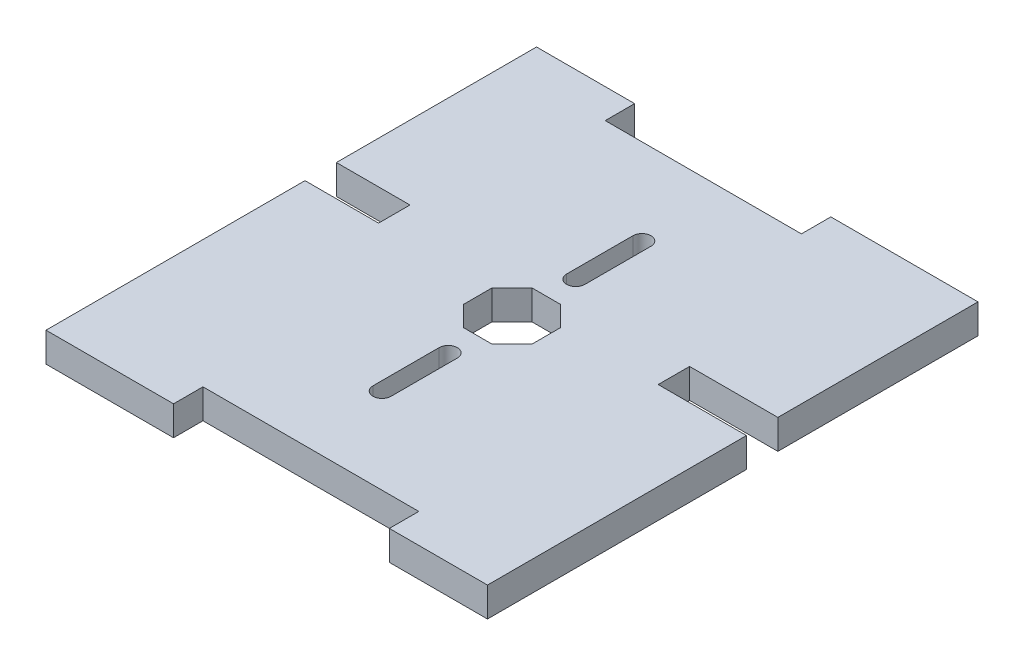
ISO-10303-21;
HEADER;
FILE_DESCRIPTION(('STEP AP214'),'2;1');
FILE_NAME('part.step','',(''),(''),'','','');
FILE_SCHEMA(('AUTOMOTIVE_DESIGN { 1 0 10303 214 1 1 1 1 }'));
ENDSEC;
DATA;
#1=APPLICATION_CONTEXT('core data for automotive mechanical design processes');
#2=APPLICATION_PROTOCOL_DEFINITION('international standard','automotive_design',2000,#1);
#3=PRODUCT_CONTEXT('',#1,'mechanical');
#4=PRODUCT('Part','Part','',(#3));
#5=PRODUCT_RELATED_PRODUCT_CATEGORY('part','',(#4));
#6=PRODUCT_DEFINITION_FORMATION('','',#4);
#7=PRODUCT_DEFINITION_CONTEXT('part definition',#1,'design');
#8=PRODUCT_DEFINITION('design','',#6,#7);
#9=PRODUCT_DEFINITION_SHAPE('','',#8);
#10=(LENGTH_UNIT() NAMED_UNIT(*) SI_UNIT(.MILLI.,.METRE.));
#11=(NAMED_UNIT(*) PLANE_ANGLE_UNIT() SI_UNIT($,.RADIAN.));
#12=(NAMED_UNIT(*) SI_UNIT($,.STERADIAN.) SOLID_ANGLE_UNIT());
#13=UNCERTAINTY_MEASURE_WITH_UNIT(LENGTH_MEASURE(1.E-05),#10,'distance_accuracy_value','');
#14=(GEOMETRIC_REPRESENTATION_CONTEXT(3) GLOBAL_UNCERTAINTY_ASSIGNED_CONTEXT((#13)) GLOBAL_UNIT_ASSIGNED_CONTEXT((#10,
#11,#12)) REPRESENTATION_CONTEXT('',''));
#15=CARTESIAN_POINT('',(0.,0.,0.));
#16=DIRECTION('',(0.,0.,1.));
#17=DIRECTION('',(1.,0.,0.));
#18=AXIS2_PLACEMENT_3D('',#15,#16,#17);
#19=CARTESIAN_POINT('',(0.,3.,0.));
#20=DIRECTION('',(1.,0.,0.));
#21=DIRECTION('',(0.,0.,-1.));
#22=AXIS2_PLACEMENT_3D('',#19,#20,#21);
#23=PLANE('',#22);
#24=DIRECTION('',(0.,0.,1.));
#25=VECTOR('',#24,1.);
#26=CARTESIAN_POINT('',(0.,0.,0.));
#27=LINE('',#26,#25);
#28=CARTESIAN_POINT('',(0.,0.,-50.));
#29=VERTEX_POINT('',#28);
#30=CARTESIAN_POINT('',(0.,0.,-29.6));
#31=VERTEX_POINT('',#30);
#32=EDGE_CURVE('E293',#29,#31,#27,.T.);
#33=ORIENTED_EDGE('',*,*,#32,.T.);
#34=DIRECTION('',(0.,1.,0.));
#35=VECTOR('',#34,1.);
#36=CARTESIAN_POINT('',(0.,0.,-29.6));
#37=LINE('',#36,#35);
#38=CARTESIAN_POINT('',(0.,3.,-29.6));
#39=VERTEX_POINT('',#38);
#40=EDGE_CURVE('E363',#31,#39,#37,.T.);
#41=ORIENTED_EDGE('',*,*,#40,.T.);
#42=DIRECTION('',(0.,0.,1.));
#43=VECTOR('',#42,1.);
#44=CARTESIAN_POINT('',(0.,3.,0.));
#45=LINE('',#44,#43);
#46=CARTESIAN_POINT('',(0.,3.,-50.));
#47=VERTEX_POINT('',#46);
#48=EDGE_CURVE('E546',#47,#39,#45,.T.);
#49=ORIENTED_EDGE('',*,*,#48,.F.);
#50=DIRECTION('',(0.,-1.,0.));
#51=VECTOR('',#50,1.);
#52=CARTESIAN_POINT('',(0.,3.,-50.));
#53=LINE('',#52,#51);
#54=EDGE_CURVE('E313',#47,#29,#53,.T.);
#55=ORIENTED_EDGE('',*,*,#54,.T.);
#56=EDGE_LOOP('',(#33,#41,#49,#55));
#57=FACE_BOUND('',#56,.T.);
#58=ADVANCED_FACE('F35',(#57),#23,.F.);
#59=CARTESIAN_POINT('',(0.,3.,0.));
#60=DIRECTION('',(0.,0.,-1.));
#61=DIRECTION('',(-1.,0.,0.));
#62=AXIS2_PLACEMENT_3D('',#59,#60,#61);
#63=PLANE('',#62);
#64=DIRECTION('',(1.,0.,0.));
#65=VECTOR('',#64,1.);
#66=CARTESIAN_POINT('',(0.,0.,0.));
#67=LINE('',#66,#65);
#68=CARTESIAN_POINT('',(0.,0.,0.));
#69=VERTEX_POINT('',#68);
#70=CARTESIAN_POINT('',(13.,0.,0.));
#71=VERTEX_POINT('',#70);
#72=EDGE_CURVE('E292',#69,#71,#67,.T.);
#73=ORIENTED_EDGE('',*,*,#72,.T.);
#74=DIRECTION('',(0.,1.,0.));
#75=VECTOR('',#74,1.);
#76=CARTESIAN_POINT('',(13.,0.,0.));
#77=LINE('',#76,#75);
#78=CARTESIAN_POINT('',(13.,3.,0.));
#79=VERTEX_POINT('',#78);
#80=EDGE_CURVE('E528',#71,#79,#77,.T.);
#81=ORIENTED_EDGE('',*,*,#80,.T.);
#82=DIRECTION('',(1.,0.,0.));
#83=VECTOR('',#82,1.);
#84=CARTESIAN_POINT('',(0.,3.,0.));
#85=LINE('',#84,#83);
#86=CARTESIAN_POINT('',(0.,3.,0.));
#87=VERTEX_POINT('',#86);
#88=EDGE_CURVE('E550',#87,#79,#85,.T.);
#89=ORIENTED_EDGE('',*,*,#88,.F.);
#90=DIRECTION('',(0.,-1.,0.));
#91=VECTOR('',#90,1.);
#92=CARTESIAN_POINT('',(0.,3.,0.));
#93=LINE('',#92,#91);
#94=EDGE_CURVE('E11',#87,#69,#93,.T.);
#95=ORIENTED_EDGE('',*,*,#94,.T.);
#96=EDGE_LOOP('',(#73,#81,#89,#95));
#97=FACE_BOUND('',#96,.T.);
#98=ADVANCED_FACE('F599',(#97),#63,.F.);
#99=CARTESIAN_POINT('',(45.,3.,0.));
#100=DIRECTION('',(-1.,0.,0.));
#101=DIRECTION('',(0.,0.,1.));
#102=AXIS2_PLACEMENT_3D('',#99,#100,#101);
#103=PLANE('',#102);
#104=DIRECTION('',(0.,0.,-1.));
#105=VECTOR('',#104,1.);
#106=CARTESIAN_POINT('',(45.,0.,0.));
#107=LINE('',#106,#105);
#108=CARTESIAN_POINT('',(45.,0.,0.));
#109=VERTEX_POINT('',#108);
#110=CARTESIAN_POINT('',(45.,0.,-26.4));
#111=VERTEX_POINT('',#110);
#112=EDGE_CURVE('E306',#109,#111,#107,.T.);
#113=ORIENTED_EDGE('',*,*,#112,.T.);
#114=DIRECTION('',(0.,1.,0.));
#115=VECTOR('',#114,1.);
#116=CARTESIAN_POINT('',(45.,0.,-26.4));
#117=LINE('',#116,#115);
#118=CARTESIAN_POINT('',(45.,3.,-26.4));
#119=VERTEX_POINT('',#118);
#120=EDGE_CURVE('E341',#111,#119,#117,.T.);
#121=ORIENTED_EDGE('',*,*,#120,.T.);
#122=DIRECTION('',(0.,0.,-1.));
#123=VECTOR('',#122,1.);
#124=CARTESIAN_POINT('',(45.,3.,0.));
#125=LINE('',#124,#123);
#126=CARTESIAN_POINT('',(45.,3.,0.));
#127=VERTEX_POINT('',#126);
#128=EDGE_CURVE('E326',#127,#119,#125,.T.);
#129=ORIENTED_EDGE('',*,*,#128,.F.);
#130=DIRECTION('',(0.,-1.,0.));
#131=VECTOR('',#130,1.);
#132=CARTESIAN_POINT('',(45.,3.,0.));
#133=LINE('',#132,#131);
#134=EDGE_CURVE('E43',#127,#109,#133,.T.);
#135=ORIENTED_EDGE('',*,*,#134,.T.);
#136=EDGE_LOOP('',(#113,#121,#129,#135));
#137=FACE_BOUND('',#136,.T.);
#138=ADVANCED_FACE('F323',(#137),#103,.F.);
#139=CARTESIAN_POINT('',(0.,3.,-50.));
#140=DIRECTION('',(0.,0.,1.));
#141=DIRECTION('',(1.,0.,0.));
#142=AXIS2_PLACEMENT_3D('',#139,#140,#141);
#143=PLANE('',#142);
#144=DIRECTION('',(-1.,0.,0.));
#145=VECTOR('',#144,1.);
#146=CARTESIAN_POINT('',(0.,3.,-50.));
#147=LINE('',#146,#145);
#148=CARTESIAN_POINT('',(10.,3.,-50.));
#149=VERTEX_POINT('',#148);
#150=EDGE_CURVE('E553',#149,#47,#147,.T.);
#151=ORIENTED_EDGE('',*,*,#150,.F.);
#152=DIRECTION('',(0.,1.,0.));
#153=VECTOR('',#152,1.);
#154=CARTESIAN_POINT('',(10.,0.,-50.));
#155=LINE('',#154,#153);
#156=CARTESIAN_POINT('',(10.,0.,-50.));
#157=VERTEX_POINT('',#156);
#158=EDGE_CURVE('E294',#157,#149,#155,.T.);
#159=ORIENTED_EDGE('',*,*,#158,.F.);
#160=DIRECTION('',(-1.,0.,0.));
#161=VECTOR('',#160,1.);
#162=CARTESIAN_POINT('',(0.,0.,-50.));
#163=LINE('',#162,#161);
#164=EDGE_CURVE('E309',#157,#29,#163,.T.);
#165=ORIENTED_EDGE('',*,*,#164,.T.);
#166=ORIENTED_EDGE('',*,*,#54,.F.);
#167=EDGE_LOOP('',(#151,#159,#165,#166));
#168=FACE_BOUND('',#167,.T.);
#169=ADVANCED_FACE('F584',(#168),#143,.F.);
#170=CARTESIAN_POINT('',(0.,3.,-26.4));
#171=VERTEX_POINT('',#170);
#172=EDGE_CURVE('E285',#171,#87,#45,.T.);
#173=ORIENTED_EDGE('',*,*,#172,.F.);
#174=DIRECTION('',(0.,1.,0.));
#175=VECTOR('',#174,1.);
#176=CARTESIAN_POINT('',(0.,0.,-26.4));
#177=LINE('',#176,#175);
#178=CARTESIAN_POINT('',(0.,0.,-26.4));
#179=VERTEX_POINT('',#178);
#180=EDGE_CURVE('E272',#179,#171,#177,.T.);
#181=ORIENTED_EDGE('',*,*,#180,.F.);
#182=EDGE_CURVE('E283',#179,#69,#27,.T.);
#183=ORIENTED_EDGE('',*,*,#182,.T.);
#184=ORIENTED_EDGE('',*,*,#94,.F.);
#185=EDGE_LOOP('',(#173,#181,#183,#184));
#186=FACE_BOUND('',#185,.T.);
#187=ADVANCED_FACE('F37',(#186),#23,.F.);
#188=CARTESIAN_POINT('',(35.,3.,0.));
#189=VERTEX_POINT('',#188);
#190=EDGE_CURVE('E549',#189,#127,#85,.T.);
#191=ORIENTED_EDGE('',*,*,#190,.F.);
#192=DIRECTION('',(0.,1.,0.));
#193=VECTOR('',#192,1.);
#194=CARTESIAN_POINT('',(35.,0.,0.));
#195=LINE('',#194,#193);
#196=CARTESIAN_POINT('',(35.,0.,0.));
#197=VERTEX_POINT('',#196);
#198=EDGE_CURVE('E540',#197,#189,#195,.T.);
#199=ORIENTED_EDGE('',*,*,#198,.F.);
#200=EDGE_CURVE('E297',#197,#109,#67,.T.);
#201=ORIENTED_EDGE('',*,*,#200,.T.);
#202=ORIENTED_EDGE('',*,*,#134,.F.);
#203=EDGE_LOOP('',(#191,#199,#201,#202));
#204=FACE_BOUND('',#203,.T.);
#205=ADVANCED_FACE('F611',(#204),#63,.F.);
#206=CARTESIAN_POINT('',(45.,3.,-29.6));
#207=VERTEX_POINT('',#206);
#208=CARTESIAN_POINT('',(45.,3.,-50.));
#209=VERTEX_POINT('',#208);
#210=EDGE_CURVE('E552',#207,#209,#125,.T.);
#211=ORIENTED_EDGE('',*,*,#210,.F.);
#212=DIRECTION('',(0.,1.,0.));
#213=VECTOR('',#212,1.);
#214=CARTESIAN_POINT('',(45.,0.,-29.6));
#215=LINE('',#214,#213);
#216=CARTESIAN_POINT('',(45.,0.,-29.6));
#217=VERTEX_POINT('',#216);
#218=EDGE_CURVE('E350',#217,#207,#215,.T.);
#219=ORIENTED_EDGE('',*,*,#218,.F.);
#220=CARTESIAN_POINT('',(45.,0.,-50.));
#221=VERTEX_POINT('',#220);
#222=EDGE_CURVE('E305',#217,#221,#107,.T.);
#223=ORIENTED_EDGE('',*,*,#222,.T.);
#224=DIRECTION('',(0.,-1.,0.));
#225=VECTOR('',#224,1.);
#226=CARTESIAN_POINT('',(45.,3.,-50.));
#227=LINE('',#226,#225);
#228=EDGE_CURVE('E316',#209,#221,#227,.T.);
#229=ORIENTED_EDGE('',*,*,#228,.F.);
#230=EDGE_LOOP('',(#211,#219,#223,#229));
#231=FACE_BOUND('',#230,.T.);
#232=ADVANCED_FACE('F565',(#231),#103,.F.);
#233=CARTESIAN_POINT('',(30.,0.,-50.));
#234=VERTEX_POINT('',#233);
#235=EDGE_CURVE('E310',#221,#234,#163,.T.);
#236=ORIENTED_EDGE('',*,*,#235,.T.);
#237=DIRECTION('',(0.,1.,0.));
#238=VECTOR('',#237,1.);
#239=CARTESIAN_POINT('',(30.,0.,-50.));
#240=LINE('',#239,#238);
#241=CARTESIAN_POINT('',(30.,3.,-50.));
#242=VERTEX_POINT('',#241);
#243=EDGE_CURVE('E298',#234,#242,#240,.T.);
#244=ORIENTED_EDGE('',*,*,#243,.T.);
#245=EDGE_CURVE('E302',#209,#242,#147,.T.);
#246=ORIENTED_EDGE('',*,*,#245,.F.);
#247=ORIENTED_EDGE('',*,*,#228,.T.);
#248=EDGE_LOOP('',(#236,#244,#246,#247));
#249=FACE_BOUND('',#248,.T.);
#250=ADVANCED_FACE('F569',(#249),#143,.F.);
#251=CARTESIAN_POINT('',(0.,3.,0.));
#252=DIRECTION('',(0.,-1.,0.));
#253=DIRECTION('',(0.,0.,-1.));
#254=AXIS2_PLACEMENT_3D('',#251,#252,#253);
#255=PLANE('',#254);
#256=DIRECTION('',(0.,0.,1.));
#257=VECTOR('',#256,1.);
#258=CARTESIAN_POINT('',(21.575,3.,-18.5));
#259=LINE('',#258,#257);
#260=CARTESIAN_POINT('',(21.575,3.,-18.5));
#261=VERTEX_POINT('',#260);
#262=CARTESIAN_POINT('',(21.575,3.,-11.75));
#263=VERTEX_POINT('',#262);
#264=EDGE_CURVE('E439',#261,#263,#259,.T.);
#265=ORIENTED_EDGE('',*,*,#264,.F.);
#266=CARTESIAN_POINT('',(22.5,3.,-18.5));
#267=DIRECTION('',(0.,1.,0.));
#268=DIRECTION('',(0.,0.,1.));
#269=AXIS2_PLACEMENT_3D('',#266,#267,#268);
#270=CIRCLE('',#269,0.925000000000002);
#271=CARTESIAN_POINT('',(23.425,3.,-18.5));
#272=VERTEX_POINT('',#271);
#273=EDGE_CURVE('E50',#272,#261,#270,.T.);
#274=ORIENTED_EDGE('',*,*,#273,.F.);
#275=DIRECTION('',(0.,0.,-1.));
#276=VECTOR('',#275,1.);
#277=CARTESIAN_POINT('',(23.425,3.,-18.5));
#278=LINE('',#277,#276);
#279=CARTESIAN_POINT('',(23.425,3.,-11.75));
#280=VERTEX_POINT('',#279);
#281=EDGE_CURVE('E428',#280,#272,#278,.T.);
#282=ORIENTED_EDGE('',*,*,#281,.F.);
#283=CARTESIAN_POINT('',(22.5,3.,-11.75));
#284=DIRECTION('',(0.,1.,0.));
#285=DIRECTION('',(0.,0.,1.));
#286=AXIS2_PLACEMENT_3D('',#283,#284,#285);
#287=CIRCLE('',#286,0.925000000000002);
#288=EDGE_CURVE('E442',#263,#280,#287,.T.);
#289=ORIENTED_EDGE('',*,*,#288,.F.);
#290=EDGE_LOOP('',(#265,#274,#282,#289));
#291=FACE_BOUND('',#290,.T.);
#292=DIRECTION('',(0.,0.,-1.));
#293=VECTOR('',#292,1.);
#294=CARTESIAN_POINT('',(23.425,3.,-31.5));
#295=LINE('',#294,#293);
#296=CARTESIAN_POINT('',(23.425,3.,-31.5));
#297=VERTEX_POINT('',#296);
#298=CARTESIAN_POINT('',(23.425,3.,-38.25));
#299=VERTEX_POINT('',#298);
#300=EDGE_CURVE('E407',#297,#299,#295,.T.);
#301=ORIENTED_EDGE('',*,*,#300,.F.);
#302=CARTESIAN_POINT('',(22.5,3.,-31.5));
#303=DIRECTION('',(0.,1.,0.));
#304=DIRECTION('',(0.,0.,1.));
#305=AXIS2_PLACEMENT_3D('',#302,#303,#304);
#306=CIRCLE('',#305,0.924999999999997);
#307=CARTESIAN_POINT('',(21.575,3.,-31.5));
#308=VERTEX_POINT('',#307);
#309=EDGE_CURVE('E58',#308,#297,#306,.T.);
#310=ORIENTED_EDGE('',*,*,#309,.F.);
#311=DIRECTION('',(0.,0.,1.));
#312=VECTOR('',#311,1.);
#313=CARTESIAN_POINT('',(21.575,3.,-31.5));
#314=LINE('',#313,#312);
#315=CARTESIAN_POINT('',(21.575,3.,-38.25));
#316=VERTEX_POINT('',#315);
#317=EDGE_CURVE('E396',#316,#308,#314,.T.);
#318=ORIENTED_EDGE('',*,*,#317,.F.);
#319=CARTESIAN_POINT('',(22.5,3.,-38.25));
#320=DIRECTION('',(0.,1.,0.));
#321=DIRECTION('',(0.,0.,1.));
#322=AXIS2_PLACEMENT_3D('',#319,#320,#321);
#323=CIRCLE('',#322,0.925);
#324=EDGE_CURVE('E411',#299,#316,#323,.T.);
#325=ORIENTED_EDGE('',*,*,#324,.F.);
#326=EDGE_LOOP('',(#301,#310,#318,#325));
#327=FACE_BOUND('',#326,.T.);
#328=DIRECTION('',(1.,0.,0.));
#329=VECTOR('',#328,1.);
#330=CARTESIAN_POINT('',(21.0502525316942,3.,-21.5));
#331=LINE('',#330,#329);
#332=CARTESIAN_POINT('',(21.0502525316942,3.,-21.5));
#333=VERTEX_POINT('',#332);
#334=CARTESIAN_POINT('',(23.9497474683058,3.,-21.5));
#335=VERTEX_POINT('',#334);
#336=EDGE_CURVE('E485',#333,#335,#331,.T.);
#337=ORIENTED_EDGE('',*,*,#336,.F.);
#338=DIRECTION('',(0.707106781186548,0.,0.707106781186548));
#339=VECTOR('',#338,1.);
#340=CARTESIAN_POINT('',(19.,3.,-23.5502525316942));
#341=LINE('',#340,#339);
#342=CARTESIAN_POINT('',(19.,3.,-23.5502525316942));
#343=VERTEX_POINT('',#342);
#344=EDGE_CURVE('E418',#343,#333,#341,.T.);
#345=ORIENTED_EDGE('',*,*,#344,.F.);
#346=DIRECTION('',(0.,0.,1.));
#347=VECTOR('',#346,1.);
#348=CARTESIAN_POINT('',(19.,3.,-26.4497474683058));
#349=LINE('',#348,#347);
#350=CARTESIAN_POINT('',(19.,3.,-26.4497474683058));
#351=VERTEX_POINT('',#350);
#352=EDGE_CURVE('E462',#351,#343,#349,.T.);
#353=ORIENTED_EDGE('',*,*,#352,.F.);
#354=DIRECTION('',(-0.707106781186547,0.,0.707106781186547));
#355=VECTOR('',#354,1.);
#356=CARTESIAN_POINT('',(21.0502525316942,3.,-28.5));
#357=LINE('',#356,#355);
#358=CARTESIAN_POINT('',(21.0502525316942,3.,-28.5));
#359=VERTEX_POINT('',#358);
#360=EDGE_CURVE('E500',#359,#351,#357,.T.);
#361=ORIENTED_EDGE('',*,*,#360,.F.);
#362=DIRECTION('',(-1.,0.,0.));
#363=VECTOR('',#362,1.);
#364=CARTESIAN_POINT('',(23.9497474683058,3.,-28.5));
#365=LINE('',#364,#363);
#366=CARTESIAN_POINT('',(23.9497474683058,3.,-28.5));
#367=VERTEX_POINT('',#366);
#368=EDGE_CURVE('E497',#367,#359,#365,.T.);
#369=ORIENTED_EDGE('',*,*,#368,.F.);
#370=DIRECTION('',(-0.707106781186548,0.,-0.707106781186548));
#371=VECTOR('',#370,1.);
#372=CARTESIAN_POINT('',(26.,3.,-26.4497474683058));
#373=LINE('',#372,#371);
#374=CARTESIAN_POINT('',(26.,3.,-26.4497474683058));
#375=VERTEX_POINT('',#374);
#376=EDGE_CURVE('E494',#375,#367,#373,.T.);
#377=ORIENTED_EDGE('',*,*,#376,.F.);
#378=DIRECTION('',(0.,0.,-1.));
#379=VECTOR('',#378,1.);
#380=CARTESIAN_POINT('',(26.,3.,-23.5502525316942));
#381=LINE('',#380,#379);
#382=CARTESIAN_POINT('',(26.,3.,-23.5502525316942));
#383=VERTEX_POINT('',#382);
#384=EDGE_CURVE('E491',#383,#375,#381,.T.);
#385=ORIENTED_EDGE('',*,*,#384,.F.);
#386=DIRECTION('',(0.707106781186547,0.,-0.707106781186547));
#387=VECTOR('',#386,1.);
#388=CARTESIAN_POINT('',(23.9497474683058,3.,-21.5));
#389=LINE('',#388,#387);
#390=EDGE_CURVE('E488',#335,#383,#389,.T.);
#391=ORIENTED_EDGE('',*,*,#390,.F.);
#392=EDGE_LOOP('',(#337,#345,#353,#361,#369,#377,#385,#391));
#393=FACE_BOUND('',#392,.T.);
#394=DIRECTION('',(0.,0.,1.));
#395=VECTOR('',#394,1.);
#396=CARTESIAN_POINT('',(36.,3.,-29.5));
#397=LINE('',#396,#395);
#398=CARTESIAN_POINT('',(36.,3.,-29.6));
#399=VERTEX_POINT('',#398);
#400=CARTESIAN_POINT('',(36.,3.,-26.4));
#401=VERTEX_POINT('',#400);
#402=EDGE_CURVE('E455',#399,#401,#397,.T.);
#403=ORIENTED_EDGE('',*,*,#402,.F.);
#404=DIRECTION('',(-1.,0.,0.));
#405=VECTOR('',#404,1.);
#406=CARTESIAN_POINT('',(45.,3.,-29.6));
#407=LINE('',#406,#405);
#408=EDGE_CURVE('E351',#207,#399,#407,.T.);
#409=ORIENTED_EDGE('',*,*,#408,.F.);
#410=ORIENTED_EDGE('',*,*,#210,.T.);
#411=ORIENTED_EDGE('',*,*,#245,.T.);
#412=DIRECTION('',(0.,0.,-1.));
#413=VECTOR('',#412,1.);
#414=CARTESIAN_POINT('',(30.,3.,-50.));
#415=LINE('',#414,#413);
#416=CARTESIAN_POINT('',(30.,3.,-47.));
#417=VERTEX_POINT('',#416);
#418=EDGE_CURVE('E372',#417,#242,#415,.T.);
#419=ORIENTED_EDGE('',*,*,#418,.F.);
#420=DIRECTION('',(1.,0.,0.));
#421=VECTOR('',#420,1.);
#422=CARTESIAN_POINT('',(10.,3.,-47.));
#423=LINE('',#422,#421);
#424=CARTESIAN_POINT('',(10.,3.,-47.));
#425=VERTEX_POINT('',#424);
#426=EDGE_CURVE('E382',#425,#417,#423,.T.);
#427=ORIENTED_EDGE('',*,*,#426,.F.);
#428=DIRECTION('',(0.,0.,1.));
#429=VECTOR('',#428,1.);
#430=CARTESIAN_POINT('',(10.,3.,-50.));
#431=LINE('',#430,#429);
#432=EDGE_CURVE('E379',#149,#425,#431,.T.);
#433=ORIENTED_EDGE('',*,*,#432,.F.);
#434=ORIENTED_EDGE('',*,*,#150,.T.);
#435=ORIENTED_EDGE('',*,*,#48,.T.);
#436=DIRECTION('',(-1.,0.,0.));
#437=VECTOR('',#436,1.);
#438=CARTESIAN_POINT('',(0.,3.,-29.6));
#439=LINE('',#438,#437);
#440=CARTESIAN_POINT('',(7.5,3.,-29.6));
#441=VERTEX_POINT('',#440);
#442=EDGE_CURVE('E361',#441,#39,#439,.T.);
#443=ORIENTED_EDGE('',*,*,#442,.F.);
#444=DIRECTION('',(0.,0.,-1.));
#445=VECTOR('',#444,1.);
#446=CARTESIAN_POINT('',(7.5,3.,-29.5));
#447=LINE('',#446,#445);
#448=CARTESIAN_POINT('',(7.5,3.,-26.4));
#449=VERTEX_POINT('',#448);
#450=EDGE_CURVE('E454',#449,#441,#447,.T.);
#451=ORIENTED_EDGE('',*,*,#450,.F.);
#452=DIRECTION('',(1.,0.,0.));
#453=VECTOR('',#452,1.);
#454=CARTESIAN_POINT('',(0.,3.,-26.4));
#455=LINE('',#454,#453);
#456=EDGE_CURVE('E278',#171,#449,#455,.T.);
#457=ORIENTED_EDGE('',*,*,#456,.F.);
#458=ORIENTED_EDGE('',*,*,#172,.T.);
#459=ORIENTED_EDGE('',*,*,#88,.T.);
#460=DIRECTION('',(0.,0.,1.));
#461=VECTOR('',#460,1.);
#462=CARTESIAN_POINT('',(13.,3.,0.));
#463=LINE('',#462,#461);
#464=CARTESIAN_POINT('',(13.,3.,-3.));
#465=VERTEX_POINT('',#464);
#466=EDGE_CURVE('E529',#465,#79,#463,.T.);
#467=ORIENTED_EDGE('',*,*,#466,.F.);
#468=DIRECTION('',(-1.,0.,0.));
#469=VECTOR('',#468,1.);
#470=CARTESIAN_POINT('',(13.,3.,-3.));
#471=LINE('',#470,#469);
#472=CARTESIAN_POINT('',(35.,3.,-3.));
#473=VERTEX_POINT('',#472);
#474=EDGE_CURVE('E523',#473,#465,#471,.T.);
#475=ORIENTED_EDGE('',*,*,#474,.F.);
#476=DIRECTION('',(0.,0.,-1.));
#477=VECTOR('',#476,1.);
#478=CARTESIAN_POINT('',(35.,3.,0.));
#479=LINE('',#478,#477);
#480=EDGE_CURVE('E531',#189,#473,#479,.T.);
#481=ORIENTED_EDGE('',*,*,#480,.F.);
#482=ORIENTED_EDGE('',*,*,#190,.T.);
#483=ORIENTED_EDGE('',*,*,#128,.T.);
#484=DIRECTION('',(1.,0.,0.));
#485=VECTOR('',#484,1.);
#486=CARTESIAN_POINT('',(45.,3.,-26.4));
#487=LINE('',#486,#485);
#488=EDGE_CURVE('E339',#401,#119,#487,.T.);
#489=ORIENTED_EDGE('',*,*,#488,.F.);
#490=EDGE_LOOP('',(#403,#409,#410,#411,#419,#427,#433,#434,#435,#443,#451,#457,#458,#459,#467,
#475,#481,#482,#483,#489));
#491=FACE_BOUND('',#490,.T.);
#492=ADVANCED_FACE('F560',(#291,#327,#393,#491),#255,.F.);
#493=CARTESIAN_POINT('',(0.,0.,0.));
#494=DIRECTION('',(0.,-1.,0.));
#495=DIRECTION('',(0.,0.,-1.));
#496=AXIS2_PLACEMENT_3D('',#493,#494,#495);
#497=PLANE('',#496);
#498=DIRECTION('',(-1.,0.,0.));
#499=VECTOR('',#498,1.);
#500=CARTESIAN_POINT('',(45.,0.,-29.6));
#501=LINE('',#500,#499);
#502=CARTESIAN_POINT('',(36.,0.,-29.6));
#503=VERTEX_POINT('',#502);
#504=EDGE_CURVE('E348',#217,#503,#501,.T.);
#505=ORIENTED_EDGE('',*,*,#504,.T.);
#506=DIRECTION('',(0.,0.,1.));
#507=VECTOR('',#506,1.);
#508=CARTESIAN_POINT('',(36.,0.,-29.5));
#509=LINE('',#508,#507);
#510=CARTESIAN_POINT('',(36.,0.,-26.4));
#511=VERTEX_POINT('',#510);
#512=EDGE_CURVE('E334',#503,#511,#509,.T.);
#513=ORIENTED_EDGE('',*,*,#512,.T.);
#514=DIRECTION('',(1.,0.,0.));
#515=VECTOR('',#514,1.);
#516=CARTESIAN_POINT('',(45.,0.,-26.4));
#517=LINE('',#516,#515);
#518=EDGE_CURVE('E333',#511,#111,#517,.T.);
#519=ORIENTED_EDGE('',*,*,#518,.T.);
#520=ORIENTED_EDGE('',*,*,#112,.F.);
#521=ORIENTED_EDGE('',*,*,#200,.F.);
#522=DIRECTION('',(0.,0.,-1.));
#523=VECTOR('',#522,1.);
#524=CARTESIAN_POINT('',(35.,0.,0.));
#525=LINE('',#524,#523);
#526=CARTESIAN_POINT('',(35.,0.,-3.));
#527=VERTEX_POINT('',#526);
#528=EDGE_CURVE('E522',#197,#527,#525,.T.);
#529=ORIENTED_EDGE('',*,*,#528,.T.);
#530=DIRECTION('',(-1.,0.,0.));
#531=VECTOR('',#530,1.);
#532=CARTESIAN_POINT('',(13.,0.,-3.));
#533=LINE('',#532,#531);
#534=CARTESIAN_POINT('',(13.,0.,-3.));
#535=VERTEX_POINT('',#534);
#536=EDGE_CURVE('E525',#527,#535,#533,.T.);
#537=ORIENTED_EDGE('',*,*,#536,.T.);
#538=DIRECTION('',(0.,0.,1.));
#539=VECTOR('',#538,1.);
#540=CARTESIAN_POINT('',(13.,0.,0.));
#541=LINE('',#540,#539);
#542=EDGE_CURVE('E520',#535,#71,#541,.T.);
#543=ORIENTED_EDGE('',*,*,#542,.T.);
#544=ORIENTED_EDGE('',*,*,#72,.F.);
#545=ORIENTED_EDGE('',*,*,#182,.F.);
#546=DIRECTION('',(1.,0.,0.));
#547=VECTOR('',#546,1.);
#548=CARTESIAN_POINT('',(0.,0.,-26.4));
#549=LINE('',#548,#547);
#550=CARTESIAN_POINT('',(7.5,0.,-26.4));
#551=VERTEX_POINT('',#550);
#552=EDGE_CURVE('E268',#179,#551,#549,.T.);
#553=ORIENTED_EDGE('',*,*,#552,.T.);
#554=DIRECTION('',(0.,0.,-1.));
#555=VECTOR('',#554,1.);
#556=CARTESIAN_POINT('',(7.5,0.,-29.5));
#557=LINE('',#556,#555);
#558=CARTESIAN_POINT('',(7.5,0.,-29.6));
#559=VERTEX_POINT('',#558);
#560=EDGE_CURVE('E532',#551,#559,#557,.T.);
#561=ORIENTED_EDGE('',*,*,#560,.T.);
#562=DIRECTION('',(-1.,0.,0.));
#563=VECTOR('',#562,1.);
#564=CARTESIAN_POINT('',(0.,0.,-29.6));
#565=LINE('',#564,#563);
#566=EDGE_CURVE('E357',#559,#31,#565,.T.);
#567=ORIENTED_EDGE('',*,*,#566,.T.);
#568=ORIENTED_EDGE('',*,*,#32,.F.);
#569=ORIENTED_EDGE('',*,*,#164,.F.);
#570=DIRECTION('',(0.,0.,1.));
#571=VECTOR('',#570,1.);
#572=CARTESIAN_POINT('',(10.,0.,-50.));
#573=LINE('',#572,#571);
#574=CARTESIAN_POINT('',(10.,0.,-47.));
#575=VERTEX_POINT('',#574);
#576=EDGE_CURVE('E368',#157,#575,#573,.T.);
#577=ORIENTED_EDGE('',*,*,#576,.T.);
#578=DIRECTION('',(1.,0.,0.));
#579=VECTOR('',#578,1.);
#580=CARTESIAN_POINT('',(10.,0.,-47.));
#581=LINE('',#580,#579);
#582=CARTESIAN_POINT('',(30.,0.,-47.));
#583=VERTEX_POINT('',#582);
#584=EDGE_CURVE('E371',#575,#583,#581,.T.);
#585=ORIENTED_EDGE('',*,*,#584,.T.);
#586=DIRECTION('',(0.,0.,-1.));
#587=VECTOR('',#586,1.);
#588=CARTESIAN_POINT('',(30.,0.,-50.));
#589=LINE('',#588,#587);
#590=EDGE_CURVE('E375',#583,#234,#589,.T.);
#591=ORIENTED_EDGE('',*,*,#590,.T.);
#592=ORIENTED_EDGE('',*,*,#235,.F.);
#593=ORIENTED_EDGE('',*,*,#222,.F.);
#594=EDGE_LOOP('',(#505,#513,#519,#520,#521,#529,#537,#543,#544,#545,#553,#561,#567,#568,#569,
#577,#585,#591,#592,#593));
#595=FACE_BOUND('',#594,.T.);
#596=CARTESIAN_POINT('',(22.5,0.,-18.5));
#597=DIRECTION('',(0.,1.,0.));
#598=DIRECTION('',(0.,0.,1.));
#599=AXIS2_PLACEMENT_3D('',#596,#597,#598);
#600=CIRCLE('',#599,0.925000000000002);
#601=CARTESIAN_POINT('',(23.425,0.,-18.5));
#602=VERTEX_POINT('',#601);
#603=CARTESIAN_POINT('',(21.575,0.,-18.5));
#604=VERTEX_POINT('',#603);
#605=EDGE_CURVE('E424',#602,#604,#600,.T.);
#606=ORIENTED_EDGE('',*,*,#605,.T.);
#607=DIRECTION('',(0.,0.,1.));
#608=VECTOR('',#607,1.);
#609=CARTESIAN_POINT('',(21.575,0.,-18.5));
#610=LINE('',#609,#608);
#611=CARTESIAN_POINT('',(21.575,0.,-11.75));
#612=VERTEX_POINT('',#611);
#613=EDGE_CURVE('E427',#604,#612,#610,.T.);
#614=ORIENTED_EDGE('',*,*,#613,.T.);
#615=CARTESIAN_POINT('',(22.5,0.,-11.75));
#616=DIRECTION('',(0.,1.,0.));
#617=DIRECTION('',(0.,0.,1.));
#618=AXIS2_PLACEMENT_3D('',#615,#616,#617);
#619=CIRCLE('',#618,0.925000000000002);
#620=CARTESIAN_POINT('',(23.425,0.,-11.75));
#621=VERTEX_POINT('',#620);
#622=EDGE_CURVE('E431',#612,#621,#619,.T.);
#623=ORIENTED_EDGE('',*,*,#622,.T.);
#624=DIRECTION('',(0.,0.,-1.));
#625=VECTOR('',#624,1.);
#626=CARTESIAN_POINT('',(23.425,0.,-18.5));
#627=LINE('',#626,#625);
#628=EDGE_CURVE('E434',#621,#602,#627,.T.);
#629=ORIENTED_EDGE('',*,*,#628,.T.);
#630=EDGE_LOOP('',(#606,#614,#623,#629));
#631=FACE_BOUND('',#630,.T.);
#632=CARTESIAN_POINT('',(22.5,0.,-31.5));
#633=DIRECTION('',(0.,1.,0.));
#634=DIRECTION('',(0.,0.,1.));
#635=AXIS2_PLACEMENT_3D('',#632,#633,#634);
#636=CIRCLE('',#635,0.924999999999997);
#637=CARTESIAN_POINT('',(21.575,0.,-31.5));
#638=VERTEX_POINT('',#637);
#639=CARTESIAN_POINT('',(23.425,0.,-31.5));
#640=VERTEX_POINT('',#639);
#641=EDGE_CURVE('E392',#638,#640,#636,.T.);
#642=ORIENTED_EDGE('',*,*,#641,.T.);
#643=DIRECTION('',(0.,0.,-1.));
#644=VECTOR('',#643,1.);
#645=CARTESIAN_POINT('',(23.425,0.,-31.5));
#646=LINE('',#645,#644);
#647=CARTESIAN_POINT('',(23.425,0.,-38.25));
#648=VERTEX_POINT('',#647);
#649=EDGE_CURVE('E395',#640,#648,#646,.T.);
#650=ORIENTED_EDGE('',*,*,#649,.T.);
#651=CARTESIAN_POINT('',(22.5,0.,-38.25));
#652=DIRECTION('',(0.,1.,0.));
#653=DIRECTION('',(0.,0.,1.));
#654=AXIS2_PLACEMENT_3D('',#651,#652,#653);
#655=CIRCLE('',#654,0.925);
#656=CARTESIAN_POINT('',(21.575,0.,-38.25));
#657=VERTEX_POINT('',#656);
#658=EDGE_CURVE('E399',#648,#657,#655,.T.);
#659=ORIENTED_EDGE('',*,*,#658,.T.);
#660=DIRECTION('',(0.,0.,1.));
#661=VECTOR('',#660,1.);
#662=CARTESIAN_POINT('',(21.575,0.,-31.5));
#663=LINE('',#662,#661);
#664=EDGE_CURVE('E402',#657,#638,#663,.T.);
#665=ORIENTED_EDGE('',*,*,#664,.T.);
#666=EDGE_LOOP('',(#642,#650,#659,#665));
#667=FACE_BOUND('',#666,.T.);
#668=DIRECTION('',(0.707106781186548,0.,0.707106781186548));
#669=VECTOR('',#668,1.);
#670=CARTESIAN_POINT('',(19.,0.,-23.5502525316942));
#671=LINE('',#670,#669);
#672=CARTESIAN_POINT('',(19.,0.,-23.5502525316942));
#673=VERTEX_POINT('',#672);
#674=CARTESIAN_POINT('',(21.0502525316942,0.,-21.5));
#675=VERTEX_POINT('',#674);
#676=EDGE_CURVE('E458',#673,#675,#671,.T.);
#677=ORIENTED_EDGE('',*,*,#676,.T.);
#678=DIRECTION('',(1.,0.,0.));
#679=VECTOR('',#678,1.);
#680=CARTESIAN_POINT('',(21.0502525316942,0.,-21.5));
#681=LINE('',#680,#679);
#682=CARTESIAN_POINT('',(23.9497474683058,0.,-21.5));
#683=VERTEX_POINT('',#682);
#684=EDGE_CURVE('E461',#675,#683,#681,.T.);
#685=ORIENTED_EDGE('',*,*,#684,.T.);
#686=DIRECTION('',(0.707106781186547,0.,-0.707106781186547));
#687=VECTOR('',#686,1.);
#688=CARTESIAN_POINT('',(23.9497474683058,0.,-21.5));
#689=LINE('',#688,#687);
#690=CARTESIAN_POINT('',(26.,0.,-23.5502525316942));
#691=VERTEX_POINT('',#690);
#692=EDGE_CURVE('E465',#683,#691,#689,.T.);
#693=ORIENTED_EDGE('',*,*,#692,.T.);
#694=DIRECTION('',(0.,0.,-1.));
#695=VECTOR('',#694,1.);
#696=CARTESIAN_POINT('',(26.,0.,-23.5502525316942));
#697=LINE('',#696,#695);
#698=CARTESIAN_POINT('',(26.,0.,-26.4497474683058));
#699=VERTEX_POINT('',#698);
#700=EDGE_CURVE('E468',#691,#699,#697,.T.);
#701=ORIENTED_EDGE('',*,*,#700,.T.);
#702=DIRECTION('',(-0.707106781186548,0.,-0.707106781186548));
#703=VECTOR('',#702,1.);
#704=CARTESIAN_POINT('',(26.,0.,-26.4497474683058));
#705=LINE('',#704,#703);
#706=CARTESIAN_POINT('',(23.9497474683058,0.,-28.5));
#707=VERTEX_POINT('',#706);
#708=EDGE_CURVE('E471',#699,#707,#705,.T.);
#709=ORIENTED_EDGE('',*,*,#708,.T.);
#710=DIRECTION('',(-1.,0.,0.));
#711=VECTOR('',#710,1.);
#712=CARTESIAN_POINT('',(23.9497474683058,0.,-28.5));
#713=LINE('',#712,#711);
#714=CARTESIAN_POINT('',(21.0502525316942,0.,-28.5));
#715=VERTEX_POINT('',#714);
#716=EDGE_CURVE('E474',#707,#715,#713,.T.);
#717=ORIENTED_EDGE('',*,*,#716,.T.);
#718=DIRECTION('',(-0.707106781186547,0.,0.707106781186547));
#719=VECTOR('',#718,1.);
#720=CARTESIAN_POINT('',(21.0502525316942,0.,-28.5));
#721=LINE('',#720,#719);
#722=CARTESIAN_POINT('',(19.,0.,-26.4497474683058));
#723=VERTEX_POINT('',#722);
#724=EDGE_CURVE('E477',#715,#723,#721,.T.);
#725=ORIENTED_EDGE('',*,*,#724,.T.);
#726=DIRECTION('',(0.,0.,1.));
#727=VECTOR('',#726,1.);
#728=CARTESIAN_POINT('',(19.,0.,-26.4497474683058));
#729=LINE('',#728,#727);
#730=EDGE_CURVE('E480',#723,#673,#729,.T.);
#731=ORIENTED_EDGE('',*,*,#730,.T.);
#732=EDGE_LOOP('',(#677,#685,#693,#701,#709,#717,#725,#731));
#733=FACE_BOUND('',#732,.T.);
#734=ADVANCED_FACE('F288',(#595,#631,#667,#733),#497,.T.);
#735=CARTESIAN_POINT('',(19.,0.,-23.5502525316942));
#736=DIRECTION('',(-0.707106781186547,0.,0.707106781186547));
#737=DIRECTION('',(0.707106781186548,0.,0.707106781186548));
#738=AXIS2_PLACEMENT_3D('',#735,#736,#737);
#739=PLANE('',#738);
#740=ORIENTED_EDGE('',*,*,#344,.T.);
#741=DIRECTION('',(0.,1.,0.));
#742=VECTOR('',#741,1.);
#743=CARTESIAN_POINT('',(21.0502525316942,0.,-21.5));
#744=LINE('',#743,#742);
#745=EDGE_CURVE('E483',#675,#333,#744,.T.);
#746=ORIENTED_EDGE('',*,*,#745,.F.);
#747=ORIENTED_EDGE('',*,*,#676,.F.);
#748=DIRECTION('',(0.,1.,0.));
#749=VECTOR('',#748,1.);
#750=CARTESIAN_POINT('',(19.,0.,-23.5502525316942));
#751=LINE('',#750,#749);
#752=EDGE_CURVE('E457',#673,#343,#751,.T.);
#753=ORIENTED_EDGE('',*,*,#752,.T.);
#754=EDGE_LOOP('',(#740,#746,#747,#753));
#755=FACE_BOUND('',#754,.T.);
#756=ADVANCED_FACE('F669',(#755),#739,.F.);
#757=CARTESIAN_POINT('',(19.,0.,-26.4497474683058));
#758=DIRECTION('',(-1.,0.,0.));
#759=DIRECTION('',(0.,0.,1.));
#760=AXIS2_PLACEMENT_3D('',#757,#758,#759);
#761=PLANE('',#760);
#762=ORIENTED_EDGE('',*,*,#352,.T.);
#763=ORIENTED_EDGE('',*,*,#752,.F.);
#764=ORIENTED_EDGE('',*,*,#730,.F.);
#765=DIRECTION('',(0.,1.,0.));
#766=VECTOR('',#765,1.);
#767=CARTESIAN_POINT('',(19.,0.,-26.4497474683058));
#768=LINE('',#767,#766);
#769=EDGE_CURVE('E506',#723,#351,#768,.T.);
#770=ORIENTED_EDGE('',*,*,#769,.T.);
#771=EDGE_LOOP('',(#762,#763,#764,#770));
#772=FACE_BOUND('',#771,.T.);
#773=ADVANCED_FACE('F770',(#772),#761,.F.);
#774=CARTESIAN_POINT('',(21.0502525316942,0.,-28.5));
#775=DIRECTION('',(-0.707106781186548,0.,-0.707106781186548));
#776=DIRECTION('',(-0.707106781186548,0.,0.707106781186548));
#777=AXIS2_PLACEMENT_3D('',#774,#775,#776);
#778=PLANE('',#777);
#779=ORIENTED_EDGE('',*,*,#360,.T.);
#780=ORIENTED_EDGE('',*,*,#769,.F.);
#781=ORIENTED_EDGE('',*,*,#724,.F.);
#782=DIRECTION('',(0.,1.,0.));
#783=VECTOR('',#782,1.);
#784=CARTESIAN_POINT('',(21.0502525316942,0.,-28.5));
#785=LINE('',#784,#783);
#786=EDGE_CURVE('E508',#715,#359,#785,.T.);
#787=ORIENTED_EDGE('',*,*,#786,.T.);
#788=EDGE_LOOP('',(#779,#780,#781,#787));
#789=FACE_BOUND('',#788,.T.);
#790=ADVANCED_FACE('F773',(#789),#778,.F.);
#791=CARTESIAN_POINT('',(23.9497474683058,0.,-28.5));
#792=DIRECTION('',(0.,0.,-1.));
#793=DIRECTION('',(-1.,0.,0.));
#794=AXIS2_PLACEMENT_3D('',#791,#792,#793);
#795=PLANE('',#794);
#796=ORIENTED_EDGE('',*,*,#368,.T.);
#797=ORIENTED_EDGE('',*,*,#786,.F.);
#798=ORIENTED_EDGE('',*,*,#716,.F.);
#799=DIRECTION('',(0.,1.,0.));
#800=VECTOR('',#799,1.);
#801=CARTESIAN_POINT('',(23.9497474683058,0.,-28.5));
#802=LINE('',#801,#800);
#803=EDGE_CURVE('E510',#707,#367,#802,.T.);
#804=ORIENTED_EDGE('',*,*,#803,.T.);
#805=EDGE_LOOP('',(#796,#797,#798,#804));
#806=FACE_BOUND('',#805,.T.);
#807=ADVANCED_FACE('F777',(#806),#795,.F.);
#808=CARTESIAN_POINT('',(26.,0.,-26.4497474683058));
#809=DIRECTION('',(0.707106781186547,0.,-0.707106781186547));
#810=DIRECTION('',(-0.707106781186548,0.,-0.707106781186548));
#811=AXIS2_PLACEMENT_3D('',#808,#809,#810);
#812=PLANE('',#811);
#813=ORIENTED_EDGE('',*,*,#376,.T.);
#814=ORIENTED_EDGE('',*,*,#803,.F.);
#815=ORIENTED_EDGE('',*,*,#708,.F.);
#816=DIRECTION('',(0.,1.,0.));
#817=VECTOR('',#816,1.);
#818=CARTESIAN_POINT('',(26.,0.,-26.4497474683058));
#819=LINE('',#818,#817);
#820=EDGE_CURVE('E512',#699,#375,#819,.T.);
#821=ORIENTED_EDGE('',*,*,#820,.T.);
#822=EDGE_LOOP('',(#813,#814,#815,#821));
#823=FACE_BOUND('',#822,.T.);
#824=ADVANCED_FACE('F781',(#823),#812,.F.);
#825=CARTESIAN_POINT('',(26.,0.,-23.5502525316942));
#826=DIRECTION('',(1.,0.,0.));
#827=DIRECTION('',(0.,0.,-1.));
#828=AXIS2_PLACEMENT_3D('',#825,#826,#827);
#829=PLANE('',#828);
#830=ORIENTED_EDGE('',*,*,#384,.T.);
#831=ORIENTED_EDGE('',*,*,#820,.F.);
#832=ORIENTED_EDGE('',*,*,#700,.F.);
#833=DIRECTION('',(0.,1.,0.));
#834=VECTOR('',#833,1.);
#835=CARTESIAN_POINT('',(26.,0.,-23.5502525316942));
#836=LINE('',#835,#834);
#837=EDGE_CURVE('E514',#691,#383,#836,.T.);
#838=ORIENTED_EDGE('',*,*,#837,.T.);
#839=EDGE_LOOP('',(#830,#831,#832,#838));
#840=FACE_BOUND('',#839,.T.);
#841=ADVANCED_FACE('F785',(#840),#829,.F.);
#842=CARTESIAN_POINT('',(23.9497474683058,0.,-21.5));
#843=DIRECTION('',(0.707106781186548,0.,0.707106781186548));
#844=DIRECTION('',(0.707106781186548,0.,-0.707106781186548));
#845=AXIS2_PLACEMENT_3D('',#842,#843,#844);
#846=PLANE('',#845);
#847=ORIENTED_EDGE('',*,*,#390,.T.);
#848=ORIENTED_EDGE('',*,*,#837,.F.);
#849=ORIENTED_EDGE('',*,*,#692,.F.);
#850=DIRECTION('',(0.,1.,0.));
#851=VECTOR('',#850,1.);
#852=CARTESIAN_POINT('',(23.9497474683058,0.,-21.5));
#853=LINE('',#852,#851);
#854=EDGE_CURVE('E516',#683,#335,#853,.T.);
#855=ORIENTED_EDGE('',*,*,#854,.T.);
#856=EDGE_LOOP('',(#847,#848,#849,#855));
#857=FACE_BOUND('',#856,.T.);
#858=ADVANCED_FACE('F789',(#857),#846,.F.);
#859=CARTESIAN_POINT('',(21.0502525316942,0.,-21.5));
#860=DIRECTION('',(0.,0.,1.));
#861=DIRECTION('',(1.,0.,0.));
#862=AXIS2_PLACEMENT_3D('',#859,#860,#861);
#863=PLANE('',#862);
#864=ORIENTED_EDGE('',*,*,#336,.T.);
#865=ORIENTED_EDGE('',*,*,#854,.F.);
#866=ORIENTED_EDGE('',*,*,#684,.F.);
#867=ORIENTED_EDGE('',*,*,#745,.T.);
#868=EDGE_LOOP('',(#864,#865,#866,#867));
#869=FACE_BOUND('',#868,.T.);
#870=ADVANCED_FACE('F680',(#869),#863,.F.);
#871=CARTESIAN_POINT('',(36.,0.,-29.5));
#872=DIRECTION('',(-1.,0.,0.));
#873=DIRECTION('',(0.,0.,1.));
#874=AXIS2_PLACEMENT_3D('',#871,#872,#873);
#875=PLANE('',#874);
#876=ORIENTED_EDGE('',*,*,#402,.T.);
#877=DIRECTION('',(0.,1.,0.));
#878=VECTOR('',#877,1.);
#879=CARTESIAN_POINT('',(36.,0.,-26.4));
#880=LINE('',#879,#878);
#881=EDGE_CURVE('E338',#511,#401,#880,.T.);
#882=ORIENTED_EDGE('',*,*,#881,.F.);
#883=ORIENTED_EDGE('',*,*,#512,.F.);
#884=DIRECTION('',(0.,1.,0.));
#885=VECTOR('',#884,1.);
#886=CARTESIAN_POINT('',(36.,0.,-29.6));
#887=LINE('',#886,#885);
#888=EDGE_CURVE('E343',#503,#399,#887,.T.);
#889=ORIENTED_EDGE('',*,*,#888,.T.);
#890=EDGE_LOOP('',(#876,#882,#883,#889));
#891=FACE_BOUND('',#890,.T.);
#892=ADVANCED_FACE('F675',(#891),#875,.F.);
#893=CARTESIAN_POINT('',(7.5,0.,-29.5));
#894=DIRECTION('',(1.,0.,0.));
#895=DIRECTION('',(0.,0.,-1.));
#896=AXIS2_PLACEMENT_3D('',#893,#894,#895);
#897=PLANE('',#896);
#898=ORIENTED_EDGE('',*,*,#450,.T.);
#899=DIRECTION('',(0.,1.,0.));
#900=VECTOR('',#899,1.);
#901=CARTESIAN_POINT('',(7.5,0.,-29.6));
#902=LINE('',#901,#900);
#903=EDGE_CURVE('E360',#559,#441,#902,.T.);
#904=ORIENTED_EDGE('',*,*,#903,.F.);
#905=ORIENTED_EDGE('',*,*,#560,.F.);
#906=DIRECTION('',(0.,1.,0.));
#907=VECTOR('',#906,1.);
#908=CARTESIAN_POINT('',(7.5,0.,-26.4));
#909=LINE('',#908,#907);
#910=EDGE_CURVE('E275',#551,#449,#909,.T.);
#911=ORIENTED_EDGE('',*,*,#910,.T.);
#912=EDGE_LOOP('',(#898,#904,#905,#911));
#913=FACE_BOUND('',#912,.T.);
#914=ADVANCED_FACE('F594',(#913),#897,.F.);
#915=CARTESIAN_POINT('',(13.,0.,0.));
#916=DIRECTION('',(-1.,0.,0.));
#917=DIRECTION('',(0.,0.,1.));
#918=AXIS2_PLACEMENT_3D('',#915,#916,#917);
#919=PLANE('',#918);
#920=ORIENTED_EDGE('',*,*,#466,.T.);
#921=ORIENTED_EDGE('',*,*,#80,.F.);
#922=ORIENTED_EDGE('',*,*,#542,.F.);
#923=DIRECTION('',(0.,1.,0.));
#924=VECTOR('',#923,1.);
#925=CARTESIAN_POINT('',(13.,0.,-3.));
#926=LINE('',#925,#924);
#927=EDGE_CURVE('E383',#535,#465,#926,.T.);
#928=ORIENTED_EDGE('',*,*,#927,.T.);
#929=EDGE_LOOP('',(#920,#921,#922,#928));
#930=FACE_BOUND('',#929,.T.);
#931=ADVANCED_FACE('F602',(#930),#919,.F.);
#932=CARTESIAN_POINT('',(13.,0.,-3.));
#933=DIRECTION('',(0.,0.,-1.));
#934=DIRECTION('',(-1.,0.,0.));
#935=AXIS2_PLACEMENT_3D('',#932,#933,#934);
#936=PLANE('',#935);
#937=ORIENTED_EDGE('',*,*,#474,.T.);
#938=ORIENTED_EDGE('',*,*,#927,.F.);
#939=ORIENTED_EDGE('',*,*,#536,.F.);
#940=DIRECTION('',(0.,1.,0.));
#941=VECTOR('',#940,1.);
#942=CARTESIAN_POINT('',(35.,0.,-3.));
#943=LINE('',#942,#941);
#944=EDGE_CURVE('E538',#527,#473,#943,.T.);
#945=ORIENTED_EDGE('',*,*,#944,.T.);
#946=EDGE_LOOP('',(#937,#938,#939,#945));
#947=FACE_BOUND('',#946,.T.);
#948=ADVANCED_FACE('F605',(#947),#936,.F.);
#949=CARTESIAN_POINT('',(35.,0.,0.));
#950=DIRECTION('',(1.,0.,0.));
#951=DIRECTION('',(0.,0.,-1.));
#952=AXIS2_PLACEMENT_3D('',#949,#950,#951);
#953=PLANE('',#952);
#954=ORIENTED_EDGE('',*,*,#480,.T.);
#955=ORIENTED_EDGE('',*,*,#944,.F.);
#956=ORIENTED_EDGE('',*,*,#528,.F.);
#957=ORIENTED_EDGE('',*,*,#198,.T.);
#958=EDGE_LOOP('',(#954,#955,#956,#957));
#959=FACE_BOUND('',#958,.T.);
#960=ADVANCED_FACE('F607',(#959),#953,.F.);
#961=CARTESIAN_POINT('',(22.5,0.,-31.5));
#962=DIRECTION('',(0.,1.,0.));
#963=DIRECTION('',(0.,0.,1.));
#964=AXIS2_PLACEMENT_3D('',#961,#962,#963);
#965=CYLINDRICAL_SURFACE('',#964,0.924999999999997);
#966=ORIENTED_EDGE('',*,*,#309,.T.);
#967=DIRECTION('',(0.,1.,0.));
#968=VECTOR('',#967,1.);
#969=CARTESIAN_POINT('',(23.425,0.,-31.5));
#970=LINE('',#969,#968);
#971=EDGE_CURVE('E405',#640,#297,#970,.T.);
#972=ORIENTED_EDGE('',*,*,#971,.F.);
#973=ORIENTED_EDGE('',*,*,#641,.F.);
#974=DIRECTION('',(0.,1.,0.));
#975=VECTOR('',#974,1.);
#976=CARTESIAN_POINT('',(21.575,0.,-31.5));
#977=LINE('',#976,#975);
#978=EDGE_CURVE('E416',#638,#308,#977,.T.);
#979=ORIENTED_EDGE('',*,*,#978,.T.);
#980=EDGE_LOOP('',(#966,#972,#973,#979));
#981=FACE_BOUND('',#980,.T.);
#982=ADVANCED_FACE('F745',(#981),#965,.F.);
#983=CARTESIAN_POINT('',(21.575,0.,-31.5));
#984=DIRECTION('',(-1.,0.,0.));
#985=DIRECTION('',(0.,0.,1.));
#986=AXIS2_PLACEMENT_3D('',#983,#984,#985);
#987=PLANE('',#986);
#988=ORIENTED_EDGE('',*,*,#317,.T.);
#989=ORIENTED_EDGE('',*,*,#978,.F.);
#990=ORIENTED_EDGE('',*,*,#664,.F.);
#991=DIRECTION('',(0.,1.,0.));
#992=VECTOR('',#991,1.);
#993=CARTESIAN_POINT('',(21.575,0.,-38.25));
#994=LINE('',#993,#992);
#995=EDGE_CURVE('E419',#657,#316,#994,.T.);
#996=ORIENTED_EDGE('',*,*,#995,.T.);
#997=EDGE_LOOP('',(#988,#989,#990,#996));
#998=FACE_BOUND('',#997,.T.);
#999=ADVANCED_FACE('F741',(#998),#987,.F.);
#1000=CARTESIAN_POINT('',(22.5,0.,-38.25));
#1001=DIRECTION('',(0.,1.,0.));
#1002=DIRECTION('',(0.,0.,1.));
#1003=AXIS2_PLACEMENT_3D('',#1000,#1001,#1002);
#1004=CYLINDRICAL_SURFACE('',#1003,0.925);
#1005=ORIENTED_EDGE('',*,*,#324,.T.);
#1006=ORIENTED_EDGE('',*,*,#995,.F.);
#1007=ORIENTED_EDGE('',*,*,#658,.F.);
#1008=DIRECTION('',(0.,1.,0.));
#1009=VECTOR('',#1008,1.);
#1010=CARTESIAN_POINT('',(23.425,0.,-38.25));
#1011=LINE('',#1010,#1009);
#1012=EDGE_CURVE('E421',#648,#299,#1011,.T.);
#1013=ORIENTED_EDGE('',*,*,#1012,.T.);
#1014=EDGE_LOOP('',(#1005,#1006,#1007,#1013));
#1015=FACE_BOUND('',#1014,.T.);
#1016=ADVANCED_FACE('F744',(#1015),#1004,.F.);
#1017=CARTESIAN_POINT('',(23.425,0.,-31.5));
#1018=DIRECTION('',(1.,0.,0.));
#1019=DIRECTION('',(0.,0.,-1.));
#1020=AXIS2_PLACEMENT_3D('',#1017,#1018,#1019);
#1021=PLANE('',#1020);
#1022=ORIENTED_EDGE('',*,*,#300,.T.);
#1023=ORIENTED_EDGE('',*,*,#1012,.F.);
#1024=ORIENTED_EDGE('',*,*,#649,.F.);
#1025=ORIENTED_EDGE('',*,*,#971,.T.);
#1026=EDGE_LOOP('',(#1022,#1023,#1024,#1025));
#1027=FACE_BOUND('',#1026,.T.);
#1028=ADVANCED_FACE('F749',(#1027),#1021,.F.);
#1029=CARTESIAN_POINT('',(22.5,0.,-18.5));
#1030=DIRECTION('',(0.,1.,0.));
#1031=DIRECTION('',(0.,0.,1.));
#1032=AXIS2_PLACEMENT_3D('',#1029,#1030,#1031);
#1033=CYLINDRICAL_SURFACE('',#1032,0.925000000000002);
#1034=ORIENTED_EDGE('',*,*,#273,.T.);
#1035=DIRECTION('',(0.,1.,0.));
#1036=VECTOR('',#1035,1.);
#1037=CARTESIAN_POINT('',(21.575,0.,-18.5));
#1038=LINE('',#1037,#1036);
#1039=EDGE_CURVE('E437',#604,#261,#1038,.T.);
#1040=ORIENTED_EDGE('',*,*,#1039,.F.);
#1041=ORIENTED_EDGE('',*,*,#605,.F.);
#1042=DIRECTION('',(0.,1.,0.));
#1043=VECTOR('',#1042,1.);
#1044=CARTESIAN_POINT('',(23.425,0.,-18.5));
#1045=LINE('',#1044,#1043);
#1046=EDGE_CURVE('E408',#602,#272,#1045,.T.);
#1047=ORIENTED_EDGE('',*,*,#1046,.T.);
#1048=EDGE_LOOP('',(#1034,#1040,#1041,#1047));
#1049=FACE_BOUND('',#1048,.T.);
#1050=ADVANCED_FACE('F753',(#1049),#1033,.F.);
#1051=CARTESIAN_POINT('',(23.425,0.,-18.5));
#1052=DIRECTION('',(1.,0.,0.));
#1053=DIRECTION('',(0.,0.,-1.));
#1054=AXIS2_PLACEMENT_3D('',#1051,#1052,#1053);
#1055=PLANE('',#1054);
#1056=ORIENTED_EDGE('',*,*,#281,.T.);
#1057=ORIENTED_EDGE('',*,*,#1046,.F.);
#1058=ORIENTED_EDGE('',*,*,#628,.F.);
#1059=DIRECTION('',(0.,1.,0.));
#1060=VECTOR('',#1059,1.);
#1061=CARTESIAN_POINT('',(23.425,0.,-11.75));
#1062=LINE('',#1061,#1060);
#1063=EDGE_CURVE('E448',#621,#280,#1062,.T.);
#1064=ORIENTED_EDGE('',*,*,#1063,.T.);
#1065=EDGE_LOOP('',(#1056,#1057,#1058,#1064));
#1066=FACE_BOUND('',#1065,.T.);
#1067=ADVANCED_FACE('F757',(#1066),#1055,.F.);
#1068=CARTESIAN_POINT('',(22.5,0.,-11.75));
#1069=DIRECTION('',(0.,1.,0.));
#1070=DIRECTION('',(0.,0.,1.));
#1071=AXIS2_PLACEMENT_3D('',#1068,#1069,#1070);
#1072=CYLINDRICAL_SURFACE('',#1071,0.925000000000002);
#1073=ORIENTED_EDGE('',*,*,#288,.T.);
#1074=ORIENTED_EDGE('',*,*,#1063,.F.);
#1075=ORIENTED_EDGE('',*,*,#622,.F.);
#1076=DIRECTION('',(0.,1.,0.));
#1077=VECTOR('',#1076,1.);
#1078=CARTESIAN_POINT('',(21.575,0.,-11.75));
#1079=LINE('',#1078,#1077);
#1080=EDGE_CURVE('E450',#612,#263,#1079,.T.);
#1081=ORIENTED_EDGE('',*,*,#1080,.T.);
#1082=EDGE_LOOP('',(#1073,#1074,#1075,#1081));
#1083=FACE_BOUND('',#1082,.T.);
#1084=ADVANCED_FACE('F760',(#1083),#1072,.F.);
#1085=CARTESIAN_POINT('',(21.575,0.,-18.5));
#1086=DIRECTION('',(-1.,0.,0.));
#1087=DIRECTION('',(0.,0.,1.));
#1088=AXIS2_PLACEMENT_3D('',#1085,#1086,#1087);
#1089=PLANE('',#1088);
#1090=ORIENTED_EDGE('',*,*,#264,.T.);
#1091=ORIENTED_EDGE('',*,*,#1080,.F.);
#1092=ORIENTED_EDGE('',*,*,#613,.F.);
#1093=ORIENTED_EDGE('',*,*,#1039,.T.);
#1094=EDGE_LOOP('',(#1090,#1091,#1092,#1093));
#1095=FACE_BOUND('',#1094,.T.);
#1096=ADVANCED_FACE('F740',(#1095),#1089,.F.);
#1097=CARTESIAN_POINT('',(10.,0.,-50.));
#1098=DIRECTION('',(-1.,0.,0.));
#1099=DIRECTION('',(0.,0.,1.));
#1100=AXIS2_PLACEMENT_3D('',#1097,#1098,#1099);
#1101=PLANE('',#1100);
#1102=ORIENTED_EDGE('',*,*,#432,.T.);
#1103=DIRECTION('',(0.,1.,0.));
#1104=VECTOR('',#1103,1.);
#1105=CARTESIAN_POINT('',(10.,0.,-47.));
#1106=LINE('',#1105,#1104);
#1107=EDGE_CURVE('E378',#575,#425,#1106,.T.);
#1108=ORIENTED_EDGE('',*,*,#1107,.F.);
#1109=ORIENTED_EDGE('',*,*,#576,.F.);
#1110=ORIENTED_EDGE('',*,*,#158,.T.);
#1111=EDGE_LOOP('',(#1102,#1108,#1109,#1110));
#1112=FACE_BOUND('',#1111,.T.);
#1113=ADVANCED_FACE('F736',(#1112),#1101,.F.);
#1114=CARTESIAN_POINT('',(30.,0.,-50.));
#1115=DIRECTION('',(1.,0.,0.));
#1116=DIRECTION('',(0.,0.,-1.));
#1117=AXIS2_PLACEMENT_3D('',#1114,#1115,#1116);
#1118=PLANE('',#1117);
#1119=ORIENTED_EDGE('',*,*,#418,.T.);
#1120=ORIENTED_EDGE('',*,*,#243,.F.);
#1121=ORIENTED_EDGE('',*,*,#590,.F.);
#1122=DIRECTION('',(0.,1.,0.));
#1123=VECTOR('',#1122,1.);
#1124=CARTESIAN_POINT('',(30.,0.,-47.));
#1125=LINE('',#1124,#1123);
#1126=EDGE_CURVE('E389',#583,#417,#1125,.T.);
#1127=ORIENTED_EDGE('',*,*,#1126,.T.);
#1128=EDGE_LOOP('',(#1119,#1120,#1121,#1127));
#1129=FACE_BOUND('',#1128,.T.);
#1130=ADVANCED_FACE('F571',(#1129),#1118,.F.);
#1131=CARTESIAN_POINT('',(10.,0.,-47.));
#1132=DIRECTION('',(0.,0.,1.));
#1133=DIRECTION('',(1.,0.,0.));
#1134=AXIS2_PLACEMENT_3D('',#1131,#1132,#1133);
#1135=PLANE('',#1134);
#1136=ORIENTED_EDGE('',*,*,#426,.T.);
#1137=ORIENTED_EDGE('',*,*,#1126,.F.);
#1138=ORIENTED_EDGE('',*,*,#584,.F.);
#1139=ORIENTED_EDGE('',*,*,#1107,.T.);
#1140=EDGE_LOOP('',(#1136,#1137,#1138,#1139));
#1141=FACE_BOUND('',#1140,.T.);
#1142=ADVANCED_FACE('F576',(#1141),#1135,.F.);
#1143=CARTESIAN_POINT('',(0.,0.,-26.4));
#1144=DIRECTION('',(0.,0.,1.));
#1145=DIRECTION('',(1.,0.,0.));
#1146=AXIS2_PLACEMENT_3D('',#1143,#1144,#1145);
#1147=PLANE('',#1146);
#1148=ORIENTED_EDGE('',*,*,#456,.T.);
#1149=ORIENTED_EDGE('',*,*,#910,.F.);
#1150=ORIENTED_EDGE('',*,*,#552,.F.);
#1151=ORIENTED_EDGE('',*,*,#180,.T.);
#1152=EDGE_LOOP('',(#1148,#1149,#1150,#1151));
#1153=FACE_BOUND('',#1152,.T.);
#1154=ADVANCED_FACE('F271',(#1153),#1147,.F.);
#1155=CARTESIAN_POINT('',(0.,0.,-29.6));
#1156=DIRECTION('',(0.,0.,-1.));
#1157=DIRECTION('',(-1.,0.,0.));
#1158=AXIS2_PLACEMENT_3D('',#1155,#1156,#1157);
#1159=PLANE('',#1158);
#1160=ORIENTED_EDGE('',*,*,#442,.T.);
#1161=ORIENTED_EDGE('',*,*,#40,.F.);
#1162=ORIENTED_EDGE('',*,*,#566,.F.);
#1163=ORIENTED_EDGE('',*,*,#903,.T.);
#1164=EDGE_LOOP('',(#1160,#1161,#1162,#1163));
#1165=FACE_BOUND('',#1164,.T.);
#1166=ADVANCED_FACE('F590',(#1165),#1159,.F.);
#1167=CARTESIAN_POINT('',(45.,0.,-29.6));
#1168=DIRECTION('',(0.,0.,-1.));
#1169=DIRECTION('',(-1.,0.,0.));
#1170=AXIS2_PLACEMENT_3D('',#1167,#1168,#1169);
#1171=PLANE('',#1170);
#1172=ORIENTED_EDGE('',*,*,#408,.T.);
#1173=ORIENTED_EDGE('',*,*,#888,.F.);
#1174=ORIENTED_EDGE('',*,*,#504,.F.);
#1175=ORIENTED_EDGE('',*,*,#218,.T.);
#1176=EDGE_LOOP('',(#1172,#1173,#1174,#1175));
#1177=FACE_BOUND('',#1176,.T.);
#1178=ADVANCED_FACE('F711',(#1177),#1171,.F.);
#1179=CARTESIAN_POINT('',(45.,0.,-26.4));
#1180=DIRECTION('',(0.,0.,1.));
#1181=DIRECTION('',(1.,0.,0.));
#1182=AXIS2_PLACEMENT_3D('',#1179,#1180,#1181);
#1183=PLANE('',#1182);
#1184=ORIENTED_EDGE('',*,*,#488,.T.);
#1185=ORIENTED_EDGE('',*,*,#120,.F.);
#1186=ORIENTED_EDGE('',*,*,#518,.F.);
#1187=ORIENTED_EDGE('',*,*,#881,.T.);
#1188=EDGE_LOOP('',(#1184,#1185,#1186,#1187));
#1189=FACE_BOUND('',#1188,.T.);
#1190=ADVANCED_FACE('F720',(#1189),#1183,.F.);
#1191=CLOSED_SHELL('',(#58,#98,#138,#169,#187,#205,#232,#250,#492,#734,#756,#773,#790,#807,#824,
#841,#858,#870,#892,#914,#931,#948,#960,#982,#999,#1016,#1028,#1050,#1067,#1084,#1096,#1113,
#1130,#1142,#1154,#1166,#1178,#1190));
#1192=MANIFOLD_SOLID_BREP('B2',#1191);
#1193=ADVANCED_BREP_SHAPE_REPRESENTATION('',(#18,#1192),#14);
#1194=SHAPE_DEFINITION_REPRESENTATION(#9,#1193);
ENDSEC;
END-ISO-10303-21;
